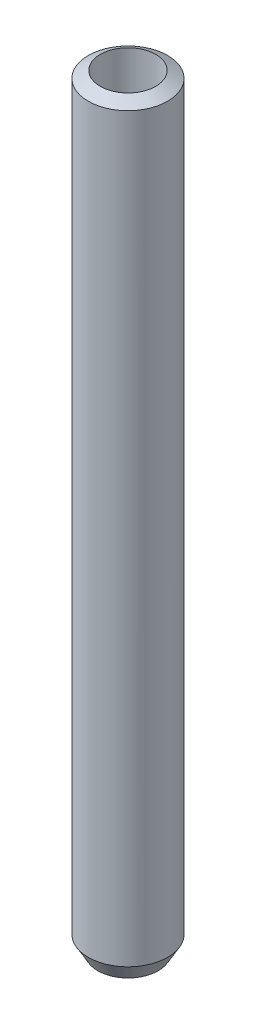
ISO-10303-21;
HEADER;
FILE_DESCRIPTION(('STEP AP214'),'2;1');
FILE_NAME('part.step','',(''),(''),'','','');
FILE_SCHEMA(('AUTOMOTIVE_DESIGN { 1 0 10303 214 1 1 1 1 }'));
ENDSEC;
DATA;
#1=APPLICATION_CONTEXT('core data for automotive mechanical design processes');
#2=APPLICATION_PROTOCOL_DEFINITION('international standard','automotive_design',2000,#1);
#3=PRODUCT_CONTEXT('',#1,'mechanical');
#4=PRODUCT('Part','Part','',(#3));
#5=PRODUCT_RELATED_PRODUCT_CATEGORY('part','',(#4));
#6=PRODUCT_DEFINITION_FORMATION('','',#4);
#7=PRODUCT_DEFINITION_CONTEXT('part definition',#1,'design');
#8=PRODUCT_DEFINITION('design','',#6,#7);
#9=PRODUCT_DEFINITION_SHAPE('','',#8);
#10=(LENGTH_UNIT() NAMED_UNIT(*) SI_UNIT(.MILLI.,.METRE.));
#11=(NAMED_UNIT(*) PLANE_ANGLE_UNIT() SI_UNIT($,.RADIAN.));
#12=(NAMED_UNIT(*) SI_UNIT($,.STERADIAN.) SOLID_ANGLE_UNIT());
#13=UNCERTAINTY_MEASURE_WITH_UNIT(LENGTH_MEASURE(1.E-05),#10,'distance_accuracy_value','');
#14=(GEOMETRIC_REPRESENTATION_CONTEXT(3) GLOBAL_UNCERTAINTY_ASSIGNED_CONTEXT((#13)) GLOBAL_UNIT_ASSIGNED_CONTEXT((#10,
#11,#12)) REPRESENTATION_CONTEXT('',''));
#15=CARTESIAN_POINT('',(0.,0.,0.));
#16=DIRECTION('',(0.,0.,1.));
#17=DIRECTION('',(1.,0.,0.));
#18=AXIS2_PLACEMENT_3D('',#15,#16,#17);
#19=CARTESIAN_POINT('',(0.,193.380026740453,0.));
#20=DIRECTION('',(0.,-1.,0.));
#21=DIRECTION('',(0.,0.,-1.));
#22=AXIS2_PLACEMENT_3D('',#19,#20,#21);
#23=CYLINDRICAL_SURFACE('',#22,10.);
#24=CARTESIAN_POINT('',(0.,190.996924012816,0.));
#25=DIRECTION('',(0.,1.,0.));
#26=DIRECTION('',(0.,0.,1.));
#27=AXIS2_PLACEMENT_3D('',#24,#25,#26);
#28=CIRCLE('',#27,10.);
#29=CARTESIAN_POINT('',(0.,190.996924012816,10.));
#30=VERTEX_POINT('',#29);
#31=EDGE_CURVE('E50',#30,#30,#28,.F.);
#32=ORIENTED_EDGE('',*,*,#31,.T.);
#33=EDGE_LOOP('',(#32));
#34=FACE_BOUND('',#33,.T.);
#35=CARTESIAN_POINT('',(0.,4.12765500392379,0.));
#36=DIRECTION('',(0.,1.,0.));
#37=DIRECTION('',(0.,0.,1.));
#38=AXIS2_PLACEMENT_3D('',#35,#36,#37);
#39=CIRCLE('',#38,10.);
#40=CARTESIAN_POINT('',(0.,4.12765500392379,10.));
#41=VERTEX_POINT('',#40);
#42=EDGE_CURVE('E51',#41,#41,#39,.T.);
#43=ORIENTED_EDGE('',*,*,#42,.T.);
#44=EDGE_LOOP('',(#43));
#45=FACE_BOUND('',#44,.T.);
#46=ADVANCED_FACE('F39',(#34,#45),#23,.T.);
#47=CARTESIAN_POINT('',(0.,0.,0.));
#48=DIRECTION('',(0.,1.,0.));
#49=DIRECTION('',(0.,0.,1.));
#50=AXIS2_PLACEMENT_3D('',#47,#48,#49);
#51=PLANE('',#50);
#52=CARTESIAN_POINT('',(0.,0.,0.));
#53=DIRECTION('',(0.,1.,0.));
#54=DIRECTION('',(0.,0.,1.));
#55=AXIS2_PLACEMENT_3D('',#52,#53,#54);
#56=CIRCLE('',#55,7.61689727236269);
#57=CARTESIAN_POINT('',(0.,0.,7.61689727236269));
#58=VERTEX_POINT('',#57);
#59=EDGE_CURVE('E10',#58,#58,#56,.F.);
#60=ORIENTED_EDGE('',*,*,#59,.T.);
#61=EDGE_LOOP('',(#60));
#62=FACE_BOUND('',#61,.T.);
#63=CARTESIAN_POINT('',(0.,0.,0.));
#64=DIRECTION('',(0.,1.,0.));
#65=DIRECTION('',(0.,0.,1.));
#66=AXIS2_PLACEMENT_3D('',#63,#64,#65);
#67=CIRCLE('',#66,6.98486087598722);
#68=CARTESIAN_POINT('',(0.,0.,6.98486087598722));
#69=VERTEX_POINT('',#68);
#70=EDGE_CURVE('E58',#69,#69,#67,.T.);
#71=ORIENTED_EDGE('',*,*,#70,.T.);
#72=EDGE_LOOP('',(#71));
#73=FACE_BOUND('',#72,.T.);
#74=ADVANCED_FACE('F62',(#62,#73),#51,.F.);
#75=CARTESIAN_POINT('',(0.,193.380026740453,0.));
#76=DIRECTION('',(0.,-1.,0.));
#77=DIRECTION('',(0.,0.,-1.));
#78=AXIS2_PLACEMENT_3D('',#75,#76,#77);
#79=CYLINDRICAL_SURFACE('',#78,6.98486087598722);
#80=CARTESIAN_POINT('',(0.,192.737715397709,0.));
#81=DIRECTION('',(0.,-1.,0.));
#82=DIRECTION('',(0.,0.,-1.));
#83=AXIS2_PLACEMENT_3D('',#80,#81,#82);
#84=CIRCLE('',#83,6.98486087598722);
#85=CARTESIAN_POINT('',(0.,192.737715397709,-6.98486087598722));
#86=VERTEX_POINT('',#85);
#87=EDGE_CURVE('E54',#86,#86,#84,.F.);
#88=ORIENTED_EDGE('',*,*,#87,.T.);
#89=EDGE_LOOP('',(#88));
#90=FACE_BOUND('',#89,.T.);
#91=ORIENTED_EDGE('',*,*,#70,.F.);
#92=EDGE_LOOP('',(#91));
#93=FACE_BOUND('',#92,.T.);
#94=ADVANCED_FACE('F68',(#90,#93),#79,.F.);
#95=CARTESIAN_POINT('',(0.,193.380026740453,0.));
#96=DIRECTION('',(0.,-1.,0.));
#97=DIRECTION('',(0.,0.,-1.));
#98=AXIS2_PLACEMENT_3D('',#95,#96,#97);
#99=CONICAL_SURFACE('',#98,5.87234499607619,1.0471975511966);
#100=ORIENTED_EDGE('',*,*,#31,.F.);
#101=EDGE_LOOP('',(#100));
#102=FACE_BOUND('',#101,.T.);
#103=ORIENTED_EDGE('',*,*,#87,.F.);
#104=EDGE_LOOP('',(#103));
#105=FACE_BOUND('',#104,.T.);
#106=ADVANCED_FACE('F66',(#102,#105),#99,.T.);
#107=CARTESIAN_POINT('',(0.,4.12765500392379,0.));
#108=DIRECTION('',(0.,1.,0.));
#109=DIRECTION('',(0.,0.,1.));
#110=AXIS2_PLACEMENT_3D('',#107,#108,#109);
#111=CONICAL_SURFACE('',#110,10.,0.523598775598301);
#112=ORIENTED_EDGE('',*,*,#59,.F.);
#113=EDGE_LOOP('',(#112));
#114=FACE_BOUND('',#113,.T.);
#115=ORIENTED_EDGE('',*,*,#42,.F.);
#116=EDGE_LOOP('',(#115));
#117=FACE_BOUND('',#116,.T.);
#118=ADVANCED_FACE('F45',(#114,#117),#111,.T.);
#119=CLOSED_SHELL('',(#46,#74,#94,#106,#118));
#120=MANIFOLD_SOLID_BREP('B2',#119);
#121=ADVANCED_BREP_SHAPE_REPRESENTATION('',(#18,#120),#14);
#122=SHAPE_DEFINITION_REPRESENTATION(#9,#121);
ENDSEC;
END-ISO-10303-21;
